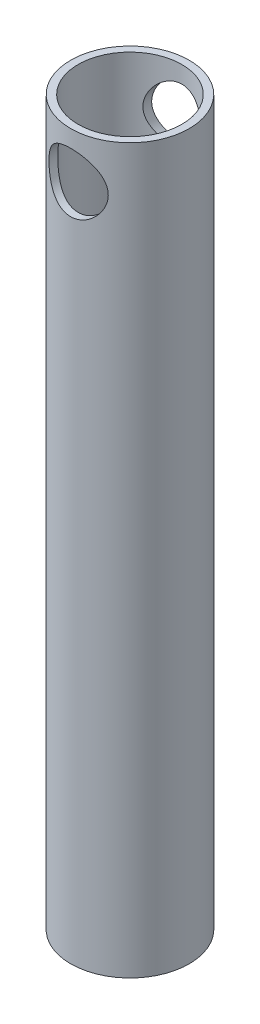
ISO-10303-21;
HEADER;
FILE_DESCRIPTION(('STEP AP214'),'2;1');
FILE_NAME('part.step','',(''),(''),'','','');
FILE_SCHEMA(('AUTOMOTIVE_DESIGN { 1 0 10303 214 1 1 1 1 }'));
ENDSEC;
DATA;
#1=APPLICATION_CONTEXT('core data for automotive mechanical design processes');
#2=APPLICATION_PROTOCOL_DEFINITION('international standard','automotive_design',2000,#1);
#3=PRODUCT_CONTEXT('',#1,'mechanical');
#4=PRODUCT('Part','Part','',(#3));
#5=PRODUCT_RELATED_PRODUCT_CATEGORY('part','',(#4));
#6=PRODUCT_DEFINITION_FORMATION('','',#4);
#7=PRODUCT_DEFINITION_CONTEXT('part definition',#1,'design');
#8=PRODUCT_DEFINITION('design','',#6,#7);
#9=PRODUCT_DEFINITION_SHAPE('','',#8);
#10=(LENGTH_UNIT() NAMED_UNIT(*) SI_UNIT(.MILLI.,.METRE.));
#11=(NAMED_UNIT(*) PLANE_ANGLE_UNIT() SI_UNIT($,.RADIAN.));
#12=(NAMED_UNIT(*) SI_UNIT($,.STERADIAN.) SOLID_ANGLE_UNIT());
#13=UNCERTAINTY_MEASURE_WITH_UNIT(LENGTH_MEASURE(1.E-05),#10,'distance_accuracy_value','');
#14=(GEOMETRIC_REPRESENTATION_CONTEXT(3) GLOBAL_UNCERTAINTY_ASSIGNED_CONTEXT((#13)) GLOBAL_UNIT_ASSIGNED_CONTEXT((#10,
#11,#12)) REPRESENTATION_CONTEXT('',''));
#15=CARTESIAN_POINT('',(0.,0.,0.));
#16=DIRECTION('',(0.,0.,1.));
#17=DIRECTION('',(1.,0.,0.));
#18=AXIS2_PLACEMENT_3D('',#15,#16,#17);
#19=CARTESIAN_POINT('',(0.,155.,0.));
#20=DIRECTION('',(0.,1.,0.));
#21=DIRECTION('',(0.,0.,1.));
#22=AXIS2_PLACEMENT_3D('',#19,#20,#21);
#23=PLANE('',#22);
#24=CARTESIAN_POINT('',(0.,155.,0.));
#25=DIRECTION('',(0.,1.,0.));
#26=DIRECTION('',(0.,0.,1.));
#27=AXIS2_PLACEMENT_3D('',#24,#25,#26);
#28=CIRCLE('',#27,12.7);
#29=CARTESIAN_POINT('',(0.,155.,12.7));
#30=VERTEX_POINT('',#29);
#31=EDGE_CURVE('E11',#30,#30,#28,.T.);
#32=ORIENTED_EDGE('',*,*,#31,.T.);
#33=EDGE_LOOP('',(#32));
#34=FACE_BOUND('',#33,.T.);
#35=CARTESIAN_POINT('',(0.,155.,0.));
#36=DIRECTION('',(0.,1.,0.));
#37=DIRECTION('',(1.,0.,0.));
#38=AXIS2_PLACEMENT_3D('',#35,#36,#37);
#39=CIRCLE('',#38,11.1125);
#40=CARTESIAN_POINT('',(11.1125,155.,0.));
#41=VERTEX_POINT('',#40);
#42=EDGE_CURVE('E55',#41,#41,#39,.T.);
#43=ORIENTED_EDGE('',*,*,#42,.F.);
#44=EDGE_LOOP('',(#43));
#45=FACE_BOUND('',#44,.T.);
#46=ADVANCED_FACE('F37',(#34,#45),#23,.T.);
#47=CARTESIAN_POINT('',(0.,0.,0.));
#48=DIRECTION('',(0.,1.,0.));
#49=DIRECTION('',(0.,0.,1.));
#50=AXIS2_PLACEMENT_3D('',#47,#48,#49);
#51=PLANE('',#50);
#52=CARTESIAN_POINT('',(0.,0.,0.));
#53=DIRECTION('',(0.,1.,0.));
#54=DIRECTION('',(0.,0.,1.));
#55=AXIS2_PLACEMENT_3D('',#52,#53,#54);
#56=CIRCLE('',#55,12.7);
#57=CARTESIAN_POINT('',(0.,0.,12.7));
#58=VERTEX_POINT('',#57);
#59=EDGE_CURVE('E50',#58,#58,#56,.T.);
#60=ORIENTED_EDGE('',*,*,#59,.F.);
#61=EDGE_LOOP('',(#60));
#62=FACE_BOUND('',#61,.T.);
#63=CARTESIAN_POINT('',(0.,0.,0.));
#64=DIRECTION('',(0.,1.,0.));
#65=DIRECTION('',(1.,0.,0.));
#66=AXIS2_PLACEMENT_3D('',#63,#64,#65);
#67=CIRCLE('',#66,11.1125);
#68=CARTESIAN_POINT('',(11.1125,0.,0.));
#69=VERTEX_POINT('',#68);
#70=EDGE_CURVE('E58',#69,#69,#67,.T.);
#71=ORIENTED_EDGE('',*,*,#70,.T.);
#72=EDGE_LOOP('',(#71));
#73=FACE_BOUND('',#72,.T.);
#74=ADVANCED_FACE('F91',(#62,#73),#51,.F.);
#75=CARTESIAN_POINT('',(0.,155.,0.));
#76=DIRECTION('',(0.,-1.,0.));
#77=DIRECTION('',(0.,0.,-1.));
#78=AXIS2_PLACEMENT_3D('',#75,#76,#77);
#79=CYLINDRICAL_SURFACE('',#78,12.7);
#80=CARTESIAN_POINT('',(0.,151.35,-12.7));
#81=CARTESIAN_POINT('',(-0.166990879194914,151.349999442176,-12.6999994891774));
#82=CARTESIAN_POINT('',(-0.333993450198632,151.343405171199,-12.6966986728259));
#83=CARTESIAN_POINT('',(-0.666768526640046,151.317103328668,-12.6835786203218));
#84=CARTESIAN_POINT('',(-0.83254046522313,151.297390052408,-12.6737565484519));
#85=CARTESIAN_POINT('',(-1.16177467728404,151.245046201311,-12.6478292478082));
#86=CARTESIAN_POINT('',(-1.32523331106835,151.21239720482,-12.6317150589571));
#87=CARTESIAN_POINT('',(-1.64849348247789,151.134543670023,-12.5936085062318));
#88=CARTESIAN_POINT('',(-1.80829349634147,151.089333999762,-12.5716137398496));
#89=CARTESIAN_POINT('',(-2.12244180878878,150.987061180329,-12.5223959142721));
#90=CARTESIAN_POINT('',(-2.27681076158407,150.930050337944,-12.4951959650805));
#91=CARTESIAN_POINT('',(-2.57993454237573,150.804600278059,-12.4361502699189));
#92=CARTESIAN_POINT('',(-2.72868724185101,150.736156779923,-12.4043027843762));
#93=CARTESIAN_POINT('',(-3.16512812193646,150.514591673514,-12.302881193969));
#94=CARTESIAN_POINT('',(-3.44334503957524,150.345121641039,-12.2273713354024));
#95=CARTESIAN_POINT('',(-3.98471796121714,149.956057493986,-12.0622186773861));
#96=CARTESIAN_POINT('',(-4.24594454614362,149.734051241793,-11.9719972312188));
#97=CARTESIAN_POINT('',(-4.72936553155196,149.251148191196,-11.7893960148839));
#98=CARTESIAN_POINT('',(-4.95153018780438,148.990222033744,-11.6970146601478));
#99=CARTESIAN_POINT('',(-5.25955398778229,148.562824866709,-11.5603243398217));
#100=CARTESIAN_POINT('',(-5.3610627049131,148.408203893761,-11.5134721485475));
#101=CARTESIAN_POINT('',(-5.55058368760465,148.089947615475,-11.4233099497228));
#102=CARTESIAN_POINT('',(-5.6386015832921,147.92631610947,-11.3799984680683));
#103=CARTESIAN_POINT('',(-5.80035808289102,147.590947864405,-11.2984098057888));
#104=CARTESIAN_POINT('',(-5.87409762464255,147.419211658605,-11.2601322945723));
#105=CARTESIAN_POINT('',(-6.00645788836521,147.0688169432,-11.1900882100936));
#106=CARTESIAN_POINT('',(-6.06508754416239,146.890162596208,-11.1583177917589));
#107=CARTESIAN_POINT('',(-6.16347180761615,146.53802379103,-11.104259497995));
#108=CARTESIAN_POINT('',(-6.20414249112448,146.364864982511,-11.08151961136));
#109=CARTESIAN_POINT('',(-6.27089941680449,146.014910090095,-11.0438804844397));
#110=CARTESIAN_POINT('',(-6.29698628284913,145.838114162125,-11.0289809087597));
#111=CARTESIAN_POINT('',(-6.33415533919377,145.482590705236,-11.0076763086803));
#112=CARTESIAN_POINT('',(-6.34525022098377,145.303864939404,-11.0012640993806));
#113=CARTESIAN_POINT('',(-6.35229110757549,144.946023457694,-10.9972004886715));
#114=CARTESIAN_POINT('',(-6.34823855771195,144.766907780649,-10.9995482514047));
#115=CARTESIAN_POINT('',(-6.32645177136463,144.431417698125,-11.012090292946));
#116=CARTESIAN_POINT('',(-6.31041699475489,144.27489264013,-11.0213095833287));
#117=CARTESIAN_POINT('',(-6.2668713449148,143.963909465342,-11.046128374712));
#118=CARTESIAN_POINT('',(-6.23935668847138,143.809452047278,-11.0617299789813));
#119=CARTESIAN_POINT('',(-6.1731687344852,143.503688703298,-11.0988027904553));
#120=CARTESIAN_POINT('',(-6.13449690187388,143.352382366441,-11.120273227066));
#121=CARTESIAN_POINT('',(-6.04639785576763,143.053761357997,-11.1684190383084));
#122=CARTESIAN_POINT('',(-5.99696641549927,142.906448280758,-11.1950964580098));
#123=CARTESIAN_POINT('',(-5.83067999912413,142.465071273065,-11.2831376118079));
#124=CARTESIAN_POINT('',(-5.69733157989736,142.178449437806,-11.351625656313));
#125=CARTESIAN_POINT('',(-5.39139880582654,141.630423149883,-11.500071400071));
#126=CARTESIAN_POINT('',(-5.21879682720649,141.36903009957,-11.5800342452273));
#127=CARTESIAN_POINT('',(-4.81373716307424,140.843812569041,-11.7546812882033));
#128=CARTESIAN_POINT('',(-4.57646495884524,140.583882329649,-11.8499465086129));
#129=CARTESIAN_POINT('',(-4.06112275052912,140.105796599138,-12.0362854764244));
#130=CARTESIAN_POINT('',(-3.78303336001457,139.887661072859,-12.1273572049435));
#131=CARTESIAN_POINT('',(-3.33286643739699,139.591778625483,-12.255938857257));
#132=CARTESIAN_POINT('',(-3.17335722609794,139.496640153278,-12.2983050254296));
#133=CARTESIAN_POINT('',(-2.8456977162644,139.320293288756,-12.3782218301755));
#134=CARTESIAN_POINT('',(-2.67755134695864,139.239078633871,-12.4157746297482));
#135=CARTESIAN_POINT('',(-2.33378760343932,139.091453428893,-12.4849579292559));
#136=CARTESIAN_POINT('',(-2.1581731635514,139.025037127134,-12.5165907293456));
#137=CARTESIAN_POINT('',(-1.80074808519268,138.907778340018,-12.5729876360055));
#138=CARTESIAN_POINT('',(-1.61893816219403,138.856934063085,-12.5977525327026));
#139=CARTESIAN_POINT('',(-1.26593635485429,138.775053040255,-12.6378915597613));
#140=CARTESIAN_POINT('',(-1.09511243698786,138.742724413691,-12.6538736459652));
#141=CARTESIAN_POINT('',(-0.750891318848441,138.692154411637,-12.6789562420375));
#142=CARTESIAN_POINT('',(-0.577494259066553,138.6739122699,-12.6880571262137));
#143=CARTESIAN_POINT('',(-0.229629611373421,138.651761276101,-12.6991158370576));
#144=CARTESIAN_POINT('',(-0.0551624794535654,138.647846693207,-12.7010765197081));
#145=CARTESIAN_POINT('',(0.29343050741757,138.654388607949,-12.6978059034872));
#146=CARTESIAN_POINT('',(0.467556377130837,138.66484446958,-12.6925749229034));
#147=CARTESIAN_POINT('',(0.800509536744072,138.698613631521,-12.6757555094506));
#148=CARTESIAN_POINT('',(0.959472887164146,138.720863074002,-12.6646934781011));
#149=CARTESIAN_POINT('',(1.2748284005213,138.777221162482,-12.6368459564446));
#150=CARTESIAN_POINT('',(1.43121967165999,138.811333834582,-12.6200585231077));
#151=CARTESIAN_POINT('',(1.74030776864039,138.891047952959,-12.581159973299));
#152=CARTESIAN_POINT('',(1.89300576133385,138.936645717272,-12.5590505630802));
#153=CARTESIAN_POINT('',(2.19390570072534,139.038914391058,-12.5099971792976));
#154=CARTESIAN_POINT('',(2.34210587161403,139.095589610032,-12.4830513245292));
#155=CARTESIAN_POINT('',(2.6372585623889,139.221262293972,-12.4240951779885));
#156=CARTESIAN_POINT('',(2.78405822350622,139.290562005097,-12.3919635638501));
#157=CARTESIAN_POINT('',(3.07126756713195,139.439781394078,-12.32392525103));
#158=CARTESIAN_POINT('',(3.21167506178121,139.519704671936,-12.2880172735192));
#159=CARTESIAN_POINT('',(3.62227376445687,139.774549113681,-12.1757741292216));
#160=CARTESIAN_POINT('',(3.88199540128409,139.964611078788,-12.0948877082824));
#161=CARTESIAN_POINT('',(4.39279994151145,140.401139844167,-11.9194499483036));
#162=CARTESIAN_POINT('',(4.640529903727,140.651312805133,-11.8243367236915));
#163=CARTESIAN_POINT('',(4.9789239543965,141.054910089851,-11.6839772811164));
#164=CARTESIAN_POINT('',(5.08625380253177,141.19427610514,-11.6375432562751));
#165=CARTESIAN_POINT('',(5.2892990887901,141.481933742679,-11.5466734049483));
#166=CARTESIAN_POINT('',(5.38501278922795,141.630226695378,-11.5022378780468));
#167=CARTESIAN_POINT('',(5.56849389071524,141.942428100611,-11.4145838039713));
#168=CARTESIAN_POINT('',(5.65564549590476,142.106745444051,-11.3715304916549));
#169=CARTESIAN_POINT('',(5.8155690937668,142.4433705339,-11.290579644901));
#170=CARTESIAN_POINT('',(5.88834801781483,142.615674378989,-11.2526796279935));
#171=CARTESIAN_POINT('',(6.01870593214494,142.967079164159,-11.1834979926119));
#172=CARTESIAN_POINT('',(6.07629712370973,143.146174515059,-11.1522110654535));
#173=CARTESIAN_POINT('',(6.17556605056228,143.50989833802,-11.0975495796607));
#174=CARTESIAN_POINT('',(6.21724624980145,143.694525948584,-11.0741737959829));
#175=CARTESIAN_POINT('',(6.28083303239844,144.049738258525,-11.038221566145));
#176=CARTESIAN_POINT('',(6.30425367574492,144.219969699185,-11.0248238589961));
#177=CARTESIAN_POINT('',(6.33722186745437,144.562205973691,-11.0059068618669));
#178=CARTESIAN_POINT('',(6.34677035930014,144.734210686132,-11.0003870360907));
#179=CARTESIAN_POINT('',(6.35184755649859,145.078431283434,-10.9974561088362));
#180=CARTESIAN_POINT('',(6.34738144738997,145.250647066626,-11.0000420081603));
#181=CARTESIAN_POINT('',(6.32451076696087,145.593833666046,-11.0132073594892));
#182=CARTESIAN_POINT('',(6.3061067662514,145.764804532951,-11.023786484255));
#183=CARTESIAN_POINT('',(6.25804920718462,146.087829689896,-11.0511312712702));
#184=CARTESIAN_POINT('',(6.22963986719981,146.240129318021,-11.0672085028909));
#185=CARTESIAN_POINT('',(6.16196939123336,146.541600360668,-11.1050268373618));
#186=CARTESIAN_POINT('',(6.12270465222517,146.690770718833,-11.1267698205995));
#187=CARTESIAN_POINT('',(5.98919755549726,147.132224331588,-11.1995485940621));
#188=CARTESIAN_POINT('',(5.87921095671372,147.418657019092,-11.2581531108883));
#189=CARTESIAN_POINT('',(5.61221709335547,147.988516005532,-11.3937155944897));
#190=CARTESIAN_POINT('',(5.45254719309571,148.270447397452,-11.4716421113511));
#191=CARTESIAN_POINT('',(5.09367320950779,148.805373073371,-11.635439817654));
#192=CARTESIAN_POINT('',(4.89444855823948,149.058352194233,-11.7213151279082));
#193=CARTESIAN_POINT('',(4.43354035272871,149.560238255138,-11.9038699110716));
#194=CARTESIAN_POINT('',(4.1672089491442,149.804915432735,-12.0005943076297));
#195=CARTESIAN_POINT('',(3.73813634318357,150.136306049974,-12.1383310810892));
#196=CARTESIAN_POINT('',(3.59004569732538,150.240905091954,-12.1830529217554));
#197=CARTESIAN_POINT('',(3.28473589884857,150.4374551776,-12.2688872478125));
#198=CARTESIAN_POINT('',(3.12752095014405,150.52941198126,-12.3100013738234));
#199=CARTESIAN_POINT('',(2.80361177397835,150.700533108515,-12.3878055405892));
#200=CARTESIAN_POINT('',(2.63685404738454,150.77959381996,-12.4244591999769));
#201=CARTESIAN_POINT('',(2.2961439976254,150.923206285418,-12.4919115290982));
#202=CARTESIAN_POINT('',(2.12219525894011,150.987765167276,-12.5227130740716));
#203=CARTESIAN_POINT('',(1.76872534139741,151.10151674034,-12.5775008101552));
#204=CARTESIAN_POINT('',(1.58921727277205,151.150742946002,-12.6015018553988));
#205=CARTESIAN_POINT('',(1.22585054083135,151.233335269034,-12.642019952057));
#206=CARTESIAN_POINT('',(1.04199460738348,151.266711074581,-12.6585415748002));
#207=CARTESIAN_POINT('',(0.715063028653905,151.311232561924,-12.6806500718221));
#208=CARTESIAN_POINT('',(0.572548812651063,151.325757901848,-12.6878936037074));
#209=CARTESIAN_POINT('',(0.286692618188964,151.345141993719,-12.6975688534566));
#210=CARTESIAN_POINT('',(0.143350616991767,151.350000478855,-12.7000004385074));
#211=CARTESIAN_POINT('',(0.,151.35,-12.7));
#212=B_SPLINE_CURVE_WITH_KNOTS('',3,(#80,#81,#82,#83,#84,#85,#86,#87,#88,#89,#90,#91,#92,#93,
#94,#95,#96,#97,#98,#99,#100,#101,#102,#103,#104,#105,#106,#107,#108,#109,#110,#111,#112,#113,
#114,#115,#116,#117,#118,#119,#120,#121,#122,#123,#124,#125,#126,#127,#128,#129,#130,#131,#132,
#133,#134,#135,#136,#137,#138,#139,#140,#141,#142,#143,#144,#145,#146,#147,#148,#149,#150,#151,
#152,#153,#154,#155,#156,#157,#158,#159,#160,#161,#162,#163,#164,#165,#166,#167,#168,#169,#170,
#171,#172,#173,#174,#175,#176,#177,#178,#179,#180,#181,#182,#183,#184,#185,#186,#187,#188,#189,
#190,#191,#192,#193,#194,#195,#196,#197,#198,#199,#200,#201,#202,#203,#204,#205,#206,#207,#208,
#209,#210,#211),.UNSPECIFIED.,.T.,.F.,(4,2,2,2,2,2,2,2,2,2,2,2,2,2,2,2,2,2,2,2,2,2,2,2,2,2,2,2,
2,2,2,2,2,2,2,2,2,2,2,2,2,2,2,2,2,2,2,2,2,2,2,2,2,2,2,2,2,2,2,2,2,2,2,2,2,4),(0.,
0.500831224205362,1.00188037372803,1.5036456429069,2.00561622220709,2.50540779268628,
3.0053869172507,4.00425210956756,5.06354639773447,6.12364383897772,6.69546056113472,
7.26703799333408,7.8385778700712,8.40977904053164,8.94696617231637,9.48413032231426,
10.020839449589,10.5574973665628,11.0297819407841,11.5022222802448,11.9746006167424,
12.447164856978,13.4133450583963,14.3799599077215,15.4691385823987,16.5588362547139,
17.1296896955319,17.7002857039293,18.2706595507726,18.8409677509571,19.3640345307036,
19.8870728558157,20.4099019497636,20.9327079051584,21.4148301207384,21.8971161172382,
22.3792476958438,22.8615672144633,23.3574791185916,23.8535595025871,24.845213267335,
25.9342484207189,26.4795520760265,27.0249372042286,27.5969396508644,28.1686655660688,
28.7399307681393,29.3111074690516,29.8274552059118,30.3437678229116,30.8598894217494,
31.3759898919437,31.8427315926275,32.3096283963947,33.2427989036526,34.2386648311406,
35.2350499582129,36.3525027406484,36.9121724680045,37.4715863502977,38.0352942497766,
38.5987244700203,39.1609143479984,39.7227601571806,40.1526787482413,40.5826092051903),.UNSPECIFIED.);
#213=CARTESIAN_POINT('',(0.,151.35,-12.7));
#214=VERTEX_POINT('',#213);
#215=EDGE_CURVE('E81',#214,#214,#212,.T.);
#216=ORIENTED_EDGE('',*,*,#215,.T.);
#217=EDGE_LOOP('',(#216));
#218=FACE_BOUND('',#217,.T.);
#219=CARTESIAN_POINT('',(6.35,145.,10.9985226280624));
#220=CARTESIAN_POINT('',(6.34999928218839,144.834478959025,10.998523579943));
#221=CARTESIAN_POINT('',(6.34351956503949,144.668943488373,11.0022718933855));
#222=CARTESIAN_POINT('',(6.31768567038666,144.339148250555,11.0171259639553));
#223=CARTESIAN_POINT('',(6.29832549915769,144.174889113329,11.028235146342));
#224=CARTESIAN_POINT('',(6.24694927679313,143.848730138198,11.0574181332929));
#225=CARTESIAN_POINT('',(6.21491337833216,143.686834415054,11.0755028588591));
#226=CARTESIAN_POINT('',(6.13857317393676,143.366749115066,11.1179955136528));
#227=CARTESIAN_POINT('',(6.09426353293934,143.208561182403,11.1424061923026));
#228=CARTESIAN_POINT('',(5.99415903275058,142.897849107027,11.1965740900206));
#229=CARTESIAN_POINT('',(5.93843230829519,142.745297426238,11.2262994639536));
#230=CARTESIAN_POINT('',(5.81586008035333,142.445689113014,11.2902857666197));
#231=CARTESIAN_POINT('',(5.74901027400277,142.298634634189,11.324548449519));
#232=CARTESIAN_POINT('',(5.53261246616049,141.8669214841,11.4326803315475));
#233=CARTESIAN_POINT('',(5.36712033451896,141.591419098183,11.5119476642213));
#234=CARTESIAN_POINT('',(4.98262520033463,141.048316307068,11.6838071707141));
#235=CARTESIAN_POINT('',(4.76033450949029,140.78324177728,11.7769591251894));
#236=CARTESIAN_POINT('',(4.27511757646096,140.292039436216,11.9616298271453));
#237=CARTESIAN_POINT('',(4.01217118797673,140.065931052113,12.0531477396846));
#238=CARTESIAN_POINT('',(3.58181894118664,139.753339129179,12.1854533541462));
#239=CARTESIAN_POINT('',(3.42694042984284,139.650866890808,12.2300194911332));
#240=CARTESIAN_POINT('',(3.10796653038441,139.45945951178,12.3149390761008));
#241=CARTESIAN_POINT('',(2.94387511411646,139.370518597955,12.3552943183467));
#242=CARTESIAN_POINT('',(2.6075308316917,139.207052061708,12.4306269282563));
#243=CARTESIAN_POINT('',(2.43527996416924,139.13252293166,12.4656056040746));
#244=CARTESIAN_POINT('',(2.0838121624779,138.998702643235,12.5291499729456));
#245=CARTESIAN_POINT('',(1.90459597055365,138.939409866327,12.557716347125));
#246=CARTESIAN_POINT('',(1.55360110174849,138.840481575007,12.6057699490627));
#247=CARTESIAN_POINT('',(1.38220025705053,138.799747753862,12.6257584795993));
#248=CARTESIAN_POINT('',(1.03596010191726,138.732594066716,12.6588712483437));
#249=CARTESIAN_POINT('',(0.861120941321367,138.706173578377,12.6719957849948));
#250=CARTESIAN_POINT('',(0.509545670906198,138.668008703585,12.6909944382569));
#251=CARTESIAN_POINT('',(0.332810574148244,138.656256838193,12.696872249662));
#252=CARTESIAN_POINT('',(-0.0211100399708893,138.64756882551,12.7012151345855));
#253=CARTESIAN_POINT('',(-0.198295529111752,138.650631771773,12.6996806616256));
#254=CARTESIAN_POINT('',(-0.536139024534008,138.670612659613,12.6897037555826));
#255=CARTESIAN_POINT('',(-0.696889924585389,138.686298142591,12.6818758695979));
#256=CARTESIAN_POINT('',(-1.01639364208415,138.729797080991,12.6602759613241));
#257=CARTESIAN_POINT('',(-1.17514576438736,138.757614642086,12.6465019267876));
#258=CARTESIAN_POINT('',(-1.4894584532589,138.825063409619,12.6133453485308));
#259=CARTESIAN_POINT('',(-1.64502010399353,138.864690529455,12.593964744986));
#260=CARTESIAN_POINT('',(-1.95208375259316,138.955373351982,12.5500373997279));
#261=CARTESIAN_POINT('',(-2.10358417059946,139.006433431989,12.5254886795239));
#262=CARTESIAN_POINT('',(-2.40359618388373,139.120263336531,12.4714177118698));
#263=CARTESIAN_POINT('',(-2.55204052401201,139.183180905512,12.4418332261982));
#264=CARTESIAN_POINT('',(-2.84303753803177,139.319726734807,12.378584432143));
#265=CARTESIAN_POINT('',(-2.98558805909761,139.393358865195,12.3449186503414));
#266=CARTESIAN_POINT('',(-3.40330077674667,139.629504557902,12.2388667565259));
#267=CARTESIAN_POINT('',(-3.66870594884561,139.807337007521,12.1613919912876));
#268=CARTESIAN_POINT('',(-4.19214222770384,140.217794287102,11.9916143211519));
#269=CARTESIAN_POINT('',(-4.44710477439445,140.454009488911,11.898602021058));
#270=CARTESIAN_POINT('',(-4.91557936546448,140.965189528168,11.7128389704504));
#271=CARTESIAN_POINT('',(-5.12905951809202,141.24018390104,11.6200884747731));
#272=CARTESIAN_POINT('',(-5.42030469839432,141.686818815703,11.485763619987));
#273=CARTESIAN_POINT('',(-5.51485253989249,141.846659687386,11.4405392812176));
#274=CARTESIAN_POINT('',(-5.68998308667919,142.174907523068,11.3544526819022));
#275=CARTESIAN_POINT('',(-5.77057209166415,142.343310578288,11.3135884568282));
#276=CARTESIAN_POINT('',(-5.91694414691516,142.687588479242,11.2377300009331));
#277=CARTESIAN_POINT('',(-5.98273594112008,142.863458838977,11.2027323066041));
#278=CARTESIAN_POINT('',(-6.09876240466926,143.221519101615,11.1399935280696));
#279=CARTESIAN_POINT('',(-6.14899919531465,143.403708139041,11.1122514544649));
#280=CARTESIAN_POINT('',(-6.22984578561014,143.758260672572,11.0671130870127));
#281=CARTESIAN_POINT('',(-6.26169488894776,143.930259605157,11.0490714421643));
#282=CARTESIAN_POINT('',(-6.31112791295724,144.276941802449,11.0209110407547));
#283=CARTESIAN_POINT('',(-6.32871263976523,144.451624914893,11.0107918364662));
#284=CARTESIAN_POINT('',(-6.34933783360541,144.802026504179,10.9989113917305));
#285=CARTESIAN_POINT('',(-6.35238708733638,144.977744291214,10.9971451019486));
#286=CARTESIAN_POINT('',(-6.34391512771207,145.328703199938,11.0020346573697));
#287=CARTESIAN_POINT('',(-6.33239489785529,145.503944353002,11.0086899340833));
#288=CARTESIAN_POINT('',(-6.29702858834734,145.833227933237,11.0289522068901));
#289=CARTESIAN_POINT('',(-6.27467427125266,145.987485852486,11.0417159534014));
#290=CARTESIAN_POINT('',(-6.21882742556196,146.293394537893,11.0732657413811));
#291=CARTESIAN_POINT('',(-6.18533121331014,146.445044424341,11.092053774483));
#292=CARTESIAN_POINT('',(-6.10756307635574,146.74474396776,11.1350636737862));
#293=CARTESIAN_POINT('',(-6.06329255357283,146.892794090366,11.1592848330139));
#294=CARTESIAN_POINT('',(-5.96439741652118,147.184542541514,11.2124534540252));
#295=CARTESIAN_POINT('',(-5.90976876141912,147.328239146238,11.2414027597031));
#296=CARTESIAN_POINT('',(-5.72551537265919,147.76469368686,11.3370282812367));
#297=CARTESIAN_POINT('',(-5.57907708861787,148.049098779655,11.4104161169009));
#298=CARTESIAN_POINT('',(-5.24691806986894,148.590767871184,11.5669168187709));
#299=CARTESIAN_POINT('',(-5.06117715583607,148.848017825444,11.6500346708705));
#300=CARTESIAN_POINT('',(-4.62807762638645,149.362333653309,11.8292979432129));
#301=CARTESIAN_POINT('',(-4.37590319113318,149.615288664133,11.9257648232535));
#302=CARTESIAN_POINT('',(-3.96769139976498,149.961033989359,12.065166834861));
#303=CARTESIAN_POINT('',(-3.82651789934348,150.070733981887,12.1107817083111));
#304=CARTESIAN_POINT('',(-3.53483089216951,150.278205287783,12.1991040176717));
#305=CARTESIAN_POINT('',(-3.38432138656765,150.375981658719,12.2418126828684));
#306=CARTESIAN_POINT('',(-3.07056676226709,150.561314306559,12.324311106221));
#307=CARTESIAN_POINT('',(-2.90708752656755,150.648523439714,12.363990945484));
#308=CARTESIAN_POINT('',(-2.5721944107138,150.808678202338,12.4379740868991));
#309=CARTESIAN_POINT('',(-2.40078408675028,150.881630149332,12.4722797690599));
#310=CARTESIAN_POINT('',(-2.0512653593288,151.012454756968,12.5345044268709));
#311=CARTESIAN_POINT('',(-1.87316019735423,151.070334610233,12.5624264481184));
#312=CARTESIAN_POINT('',(-1.51161329943788,151.170307055066,12.6110379217182));
#313=CARTESIAN_POINT('',(-1.32817219909653,151.212401518709,12.631728231699));
#314=CARTESIAN_POINT('',(-0.974600005100294,151.277095576751,12.6636770700622));
#315=CARTESIAN_POINT('',(-0.804792658673197,151.301129888792,12.6756269918235));
#316=CARTESIAN_POINT('',(-0.46345365091476,151.335386692103,12.6926908731773));
#317=CARTESIAN_POINT('',(-0.291922123840614,151.345610250512,12.6978053609347));
#318=CARTESIAN_POINT('',(0.0514197228064791,151.352112324678,12.7010560032391));
#319=CARTESIAN_POINT('',(0.223229946689187,151.348394898908,12.6991941887141));
#320=CARTESIAN_POINT('',(0.565766947207412,151.327072899227,12.6885485999153));
#321=CARTESIAN_POINT('',(0.736493753538921,151.309468707619,12.6797650161974));
#322=CARTESIAN_POINT('',(1.06426294389699,151.262221827235,12.656323875626));
#323=CARTESIAN_POINT('',(1.22146310076638,151.233453133058,12.6420936187697));
#324=CARTESIAN_POINT('',(1.53273401365724,151.164304658465,12.6081419891862));
#325=CARTESIAN_POINT('',(1.68680375641299,151.123921180666,12.5884188679554));
#326=CARTESIAN_POINT('',(1.99076490548927,151.031961705446,12.5439405267035));
#327=CARTESIAN_POINT('',(2.14065747495022,150.980388859582,12.5191867237303));
#328=CARTESIAN_POINT('',(2.43552149277719,150.866491998369,12.4651801096243));
#329=CARTESIAN_POINT('',(2.58049099991492,150.804163799623,12.4359255483614));
#330=CARTESIAN_POINT('',(2.87074641869221,150.666409622443,12.3722192421227));
#331=CARTESIAN_POINT('',(3.01578543185329,150.59054054922,12.3375997987591));
#332=CARTESIAN_POINT('',(3.29896153439148,150.428260237012,12.2649198034212));
#333=CARTESIAN_POINT('',(3.43709624818683,150.341845404238,12.2268580795355));
#334=CARTESIAN_POINT('',(3.84016496827813,150.067659743303,12.1087310292377));
#335=CARTESIAN_POINT('',(4.09390524315912,149.864880017551,12.0246914862318));
#336=CARTESIAN_POINT('',(4.5905787750526,149.401768441753,11.8445434508042));
#337=CARTESIAN_POINT('',(4.82992340312281,149.137717377949,11.7480662044738));
#338=CARTESIAN_POINT('',(5.15393253428056,148.713655057777,11.6077957563044));
#339=CARTESIAN_POINT('',(5.2561719682572,148.567502296364,11.561743086175));
#340=CARTESIAN_POINT('',(5.44837322320644,148.266435970663,11.472420936867));
#341=CARTESIAN_POINT('',(5.53833333567739,148.111521191493,11.4291518454276));
#342=CARTESIAN_POINT('',(5.70789559273796,147.788679501392,11.3454468235068));
#343=CARTESIAN_POINT('',(5.7870743435929,147.620494869675,11.3051457990152));
#344=CARTESIAN_POINT('',(5.93072175033349,147.276775259839,11.2304539202442));
#345=CARTESIAN_POINT('',(5.99519798249186,147.101244122851,11.1960600242609));
#346=CARTESIAN_POINT('',(6.10854208064732,146.744464748163,11.1346246153698));
#347=CARTESIAN_POINT('',(6.15745010027587,146.563232564874,11.1075642151338));
#348=CARTESIAN_POINT('',(6.23913851107982,146.196222244943,11.0618875330189));
#349=CARTESIAN_POINT('',(6.27193017812066,146.010447382406,11.0432653480253));
#350=CARTESIAN_POINT('',(6.31421523734848,145.687072815032,11.0191238073291));
#351=CARTESIAN_POINT('',(6.32762170528343,145.55013331219,11.0114171350384));
#352=CARTESIAN_POINT('',(6.34551468363466,145.27546590502,11.0011159783553));
#353=CARTESIAN_POINT('',(6.35000059732526,145.137737948567,10.9985218359571));
#354=CARTESIAN_POINT('',(6.35,145.,10.9985226280624));
#355=B_SPLINE_CURVE_WITH_KNOTS('',3,(#219,#220,#221,#222,#223,#224,#225,#226,#227,#228,#229,
#230,#231,#232,#233,#234,#235,#236,#237,#238,#239,#240,#241,#242,#243,#244,#245,#246,#247,#248,
#249,#250,#251,#252,#253,#254,#255,#256,#257,#258,#259,#260,#261,#262,#263,#264,#265,#266,#267,
#268,#269,#270,#271,#272,#273,#274,#275,#276,#277,#278,#279,#280,#281,#282,#283,#284,#285,#286,
#287,#288,#289,#290,#291,#292,#293,#294,#295,#296,#297,#298,#299,#300,#301,#302,#303,#304,#305,
#306,#307,#308,#309,#310,#311,#312,#313,#314,#315,#316,#317,#318,#319,#320,#321,#322,#323,#324,
#325,#326,#327,#328,#329,#330,#331,#332,#333,#334,#335,#336,#337,#338,#339,#340,#341,#342,#343,
#344,#345,#346,#347,#348,#349,#350,#351,#352,#353,#354),.UNSPECIFIED.,.T.,.F.,(4,2,2,2,2,2,2,2,
2,2,2,2,2,2,2,2,2,2,2,2,2,2,2,2,2,2,2,2,2,2,2,2,2,2,2,2,2,2,2,2,2,2,2,2,2,2,2,2,2,2,2,2,2,2,2,2,
2,2,2,2,2,2,2,2,2,2,2,4),(0.,0.496420628386746,0.993072420345703,1.49050495383882,
1.98815404798092,2.48291553757601,2.9778688680815,3.96684409062693,5.03738796841401,
6.10846404790778,6.68078530471611,7.25286169053385,7.82479866524645,8.3966748589543,
8.92786962152971,9.45904128608265,9.98994201685748,10.5208102648013,11.0053494342498,
11.4900527062196,11.9745884449401,12.4593100150646,12.950526958068,13.4419217698919,
14.4241248232063,15.4991729719626,16.5750443780613,17.1478350421015,17.720366525317,
18.2925587952272,18.8646729984724,19.3914775559145,19.9182523394805,20.4447086470812,
20.9711294186693,21.4397670532095,21.908559779714,22.3772915409524,22.8462065377767,
23.8265350298733,24.8073680830597,25.9118399254557,26.4648639531134,27.017652586129,
27.5853637388286,28.1528227588559,28.7200104808045,29.2871309155675,29.802197945893,
30.3172251753647,30.8321024827271,31.3469656160427,31.827748508727,32.3086846208015,
32.7894854495582,33.270473713564,33.7718435732796,34.273384769681,35.2759913103902,
36.3783774564738,36.9304975296671,37.4826943447722,38.0525552763948,38.6221218892067,
39.1902073402293,39.7578947603406,40.1709623989989,40.5840576682025),.UNSPECIFIED.);
#356=CARTESIAN_POINT('',(6.35,145.,10.9985226280624));
#357=VERTEX_POINT('',#356);
#358=EDGE_CURVE('E77',#357,#357,#355,.T.);
#359=ORIENTED_EDGE('',*,*,#358,.T.);
#360=EDGE_LOOP('',(#359));
#361=FACE_BOUND('',#360,.T.);
#362=ORIENTED_EDGE('',*,*,#31,.F.);
#363=EDGE_LOOP('',(#362));
#364=FACE_BOUND('',#363,.T.);
#365=ORIENTED_EDGE('',*,*,#59,.T.);
#366=EDGE_LOOP('',(#365));
#367=FACE_BOUND('',#366,.T.);
#368=ADVANCED_FACE('F39',(#218,#361,#364,#367),#79,.T.);
#369=CARTESIAN_POINT('',(0.,155.,0.));
#370=DIRECTION('',(0.,-1.,0.));
#371=DIRECTION('',(0.,0.,-1.));
#372=AXIS2_PLACEMENT_3D('',#369,#370,#371);
#373=CYLINDRICAL_SURFACE('',#372,11.1125);
#374=CARTESIAN_POINT('',(0.,151.35,-11.1125));
#375=CARTESIAN_POINT('',(-0.163789182274865,151.349998587391,-11.1124987193567));
#376=CARTESIAN_POINT('',(-0.327629128578457,151.343652913242,-11.1088693064788));
#377=CARTESIAN_POINT('',(-0.654085912433475,151.31834675529,-11.0944381185428));
#378=CARTESIAN_POINT('',(-0.816701920974139,151.299378384698,-11.0836318593259));
#379=CARTESIAN_POINT('',(-1.13971905284884,151.249024584509,-11.0550908256635));
#380=CARTESIAN_POINT('',(-1.30011511022562,151.217614458177,-11.03734227173));
#381=CARTESIAN_POINT('',(-1.61726609325167,151.142761220753,-10.9953496184125));
#382=CARTESIAN_POINT('',(-1.77401943318414,151.099312971873,-10.9711027457359));
#383=CARTESIAN_POINT('',(-2.08199776129995,151.001147026139,-10.9168335923382));
#384=CARTESIAN_POINT('',(-2.23324736337085,150.946489421563,-10.8868421620341));
#385=CARTESIAN_POINT('',(-2.53024463011943,150.826324347807,-10.8216761904037));
#386=CARTESIAN_POINT('',(-2.67599018834381,150.760812775354,-10.7864996894518));
#387=CARTESIAN_POINT('',(-3.10359647441188,150.548984297966,-10.674359074649));
#388=CARTESIAN_POINT('',(-3.37622520059919,150.387244995147,-10.5907106620075));
#389=CARTESIAN_POINT('',(-3.9106715073846,150.014277378694,-10.4057691112419));
#390=CARTESIAN_POINT('',(-4.17028523550964,149.800317977128,-10.3036378350192));
#391=CARTESIAN_POINT('',(-4.53141063695516,149.451618019353,-10.1474768125783));
#392=CARTESIAN_POINT('',(-4.64716119796353,149.330636608721,-10.0948805006451));
#393=CARTESIAN_POINT('',(-4.86883414237915,149.079823109888,-9.98985145364251));
#394=CARTESIAN_POINT('',(-4.97475472030148,148.949989403342,-9.93741875032558));
#395=CARTESIAN_POINT('',(-5.18722276491485,148.667395195762,-9.82833425876501));
#396=CARTESIAN_POINT('',(-5.29258286171642,148.513677573716,-9.77184466338238));
#397=CARTESIAN_POINT('',(-5.48986923610041,148.19666718342,-9.66238677907194));
#398=CARTESIAN_POINT('',(-5.58179671018849,148.033375269815,-9.60941817674244));
#399=CARTESIAN_POINT('',(-5.75132663963913,147.698144178537,-9.50892223651364));
#400=CARTESIAN_POINT('',(-5.82894503852306,147.52621490009,-9.46138886525736));
#401=CARTESIAN_POINT('',(-5.96906489099455,147.174525650131,-9.37362073652479));
#402=CARTESIAN_POINT('',(-6.03157130399761,146.994768270542,-9.33338358567887));
#403=CARTESIAN_POINT('',(-6.12848290731384,146.669227060463,-9.2699472013044));
#404=CARTESIAN_POINT('',(-6.16604571819255,146.524727189919,-9.24494802025014));
#405=CARTESIAN_POINT('',(-6.23103019113534,146.232537560372,-9.20127473419396));
#406=CARTESIAN_POINT('',(-6.2584540118862,146.084848487475,-9.18259928288155));
#407=CARTESIAN_POINT('',(-6.30279529830521,145.787320251148,-9.15222116245191));
#408=CARTESIAN_POINT('',(-6.31972201465444,145.637483100235,-9.14051235427911));
#409=CARTESIAN_POINT('',(-6.34286840650351,145.336582516618,-9.12446585084189));
#410=CARTESIAN_POINT('',(-6.34908786840743,145.185519059512,-9.12012830262463));
#411=CARTESIAN_POINT('',(-6.35072675890009,144.883099262711,-9.11898717572708));
#412=CARTESIAN_POINT('',(-6.34613149556416,144.73174280402,-9.12219384594958));
#413=CARTESIAN_POINT('',(-6.32617972925881,144.430087630051,-9.13604137072775));
#414=CARTESIAN_POINT('',(-6.31082318374092,144.279788918958,-9.14668225467717));
#415=CARTESIAN_POINT('',(-6.26956140717988,143.98126785318,-9.17501386064166));
#416=CARTESIAN_POINT('',(-6.24365203082822,143.833046338142,-9.19270735296752));
#417=CARTESIAN_POINT('',(-6.181612291515,143.539634395541,-9.23453963420613));
#418=CARTESIAN_POINT('',(-6.14547779716498,143.394445218686,-9.25868102812731));
#419=CARTESIAN_POINT('',(-6.06358276516131,143.108578857831,-9.31251885941886));
#420=CARTESIAN_POINT('',(-6.01786492154381,142.967884749259,-9.3421905960833));
#421=CARTESIAN_POINT('',(-5.91714143068885,142.690960636889,-9.4063093005039));
#422=CARTESIAN_POINT('',(-5.86213273213707,142.554732117293,-9.44075783639501));
#423=CARTESIAN_POINT('',(-5.68384138406894,142.153590889338,-9.54992330536148));
#424=CARTESIAN_POINT('',(-5.54725255369823,141.896081494694,-9.63048817261377));
#425=CARTESIAN_POINT('',(-5.21723930061993,141.364639573466,-9.8137162070062));
#426=CARTESIAN_POINT('',(-5.01821456576571,141.094688189351,-9.91785171069548));
#427=CARTESIAN_POINT('',(-4.69016607811462,140.715983061579,-10.0749588662349));
#428=CARTESIAN_POINT('',(-4.57580215836227,140.594037600451,-10.127517911557));
#429=CARTESIAN_POINT('',(-4.33757365051822,140.359320387957,-10.2318130372492));
#430=CARTESIAN_POINT('',(-4.21370745945026,140.246550191044,-10.2835489769812));
#431=CARTESIAN_POINT('',(-3.94228596672723,140.018454212943,-10.3908469155461));
#432=CARTESIAN_POINT('',(-3.79364125948813,139.904309669506,-10.4461703100015));
#433=CARTESIAN_POINT('',(-3.4859305021919,139.689065758752,-10.5528406185058));
#434=CARTESIAN_POINT('',(-3.32686871710472,139.587961102357,-10.6041891413932));
#435=CARTESIAN_POINT('',(-2.99915328751337,139.399707373035,-10.7014925093249));
#436=CARTESIAN_POINT('',(-2.83050170205786,139.312555319531,-10.7474485057677));
#437=CARTESIAN_POINT('',(-2.48465393547031,139.153186119468,-10.8326290092149));
#438=CARTESIAN_POINT('',(-2.30745881728339,139.080967120893,-10.8718543508605));
#439=CARTESIAN_POINT('',(-1.95834408609262,138.95688002499,-10.9399248473026));
#440=CARTESIAN_POINT('',(-1.78690503110863,138.903951040479,-10.9692997268987));
#441=CARTESIAN_POINT('',(-1.43906988764793,138.812601323608,-11.0203276192939));
#442=CARTESIAN_POINT('',(-1.26267397979208,138.774180063342,-11.0419809130641));
#443=CARTESIAN_POINT('',(-0.906583181388617,138.712454145979,-11.0769012573418));
#444=CARTESIAN_POINT('',(-0.726891124901351,138.689137075958,-11.0901751939431));
#445=CARTESIAN_POINT('',(-0.365746762294528,138.657952490083,-11.1079501199315));
#446=CARTESIAN_POINT('',(-0.184294655501171,138.650083244823,-11.1124520913529));
#447=CARTESIAN_POINT('',(0.156551233178865,138.649928069854,-11.1125414018011));
#448=CARTESIAN_POINT('',(0.315947453758273,138.655865551773,-11.1091450566475));
#449=CARTESIAN_POINT('',(0.633554741466065,138.679678455907,-11.0955632409524));
#450=CARTESIAN_POINT('',(0.791765828213269,138.697553680059,-11.0853778830491));
#451=CARTESIAN_POINT('',(1.10584248293701,138.745014946456,-11.0584634211064));
#452=CARTESIAN_POINT('',(1.26170815931694,138.774600445724,-11.0417346204714));
#453=CARTESIAN_POINT('',(1.5700471905699,138.845126470104,-11.0021258998364));
#454=CARTESIAN_POINT('',(1.72252044266783,138.886067338729,-10.9792457937537));
#455=CARTESIAN_POINT('',(2.02154850851587,138.978367139195,-10.9281177035519));
#456=CARTESIAN_POINT('',(2.16814875191671,139.029611767309,-10.8999288122875));
#457=CARTESIAN_POINT('',(2.45633694201108,139.142280519067,-10.83862581059));
#458=CARTESIAN_POINT('',(2.59792323667484,139.203707960629,-10.8055100951865));
#459=CARTESIAN_POINT('',(3.01405600421986,139.402470594976,-10.6997583210323));
#460=CARTESIAN_POINT('',(3.28018372388136,139.554350873555,-10.6206807757402));
#461=CARTESIAN_POINT('',(3.81165777450687,139.910146000984,-10.4424911716952));
#462=CARTESIAN_POINT('',(4.07403940401034,140.117831526829,-10.3421505076206));
#463=CARTESIAN_POINT('',(4.56240375851506,140.570785682719,-10.1361910862346));
#464=CARTESIAN_POINT('',(4.78834422290967,140.816097313687,-10.0305663843328));
#465=CARTESIAN_POINT('',(5.10833813702035,141.22353426778,-9.86959991824147));
#466=CARTESIAN_POINT('',(5.21642280726782,141.374262741876,-9.81274585454842));
#467=CARTESIAN_POINT('',(5.41949435046243,141.685473127364,-9.70206624310501));
#468=CARTESIAN_POINT('',(5.51447803383916,141.845957400253,-9.64824143473959));
#469=CARTESIAN_POINT('',(5.69042781328817,142.175741421206,-9.54552604341733));
#470=CARTESIAN_POINT('',(5.77140670823898,142.345032934326,-9.49663097243614));
#471=CARTESIAN_POINT('',(5.91854271955343,142.69159296876,-9.40563628246293));
#472=CARTESIAN_POINT('',(5.98471054905824,142.868855612214,-9.36353175793383));
#473=CARTESIAN_POINT('',(6.08892448962093,143.191732225217,-9.29600151375372));
#474=CARTESIAN_POINT('',(6.12995855713196,143.336044270668,-9.26893347358905));
#475=CARTESIAN_POINT('',(6.20185955716912,143.628126022175,-9.22097964131551));
#476=CARTESIAN_POINT('',(6.23273179853649,143.775893879456,-9.20009062168179));
#477=CARTESIAN_POINT('',(6.28392783384962,144.073935973179,-9.16519882994749));
#478=CARTESIAN_POINT('',(6.3042598354546,144.224208165094,-9.15119070016199));
#479=CARTESIAN_POINT('',(6.33412830023861,144.526333819794,-9.13054254202809));
#480=CARTESIAN_POINT('',(6.34366459657401,144.678187306979,-9.12390262755277));
#481=CARTESIAN_POINT('',(6.35180552534442,144.982639474066,-9.1182371424447));
#482=CARTESIAN_POINT('',(6.35038798008045,145.135239040312,-9.11922701946157));
#483=CARTESIAN_POINT('',(6.33659153338375,145.439696456049,-9.12881878912143));
#484=CARTESIAN_POINT('',(6.3242125914335,145.591554302796,-9.13742070990146));
#485=CARTESIAN_POINT('',(6.28866704495836,145.893459931468,-9.16192059731151));
#486=CARTESIAN_POINT('',(6.26549670286389,146.043507067771,-9.1778210917534));
#487=CARTESIAN_POINT('',(6.20868929729764,146.340750397674,-9.21634397852355));
#488=CARTESIAN_POINT('',(6.17504800064379,146.48794541261,-9.23896908930269));
#489=CARTESIAN_POINT('',(6.06037275506286,146.918716241187,-9.31493041309819));
#490=CARTESIAN_POINT('',(5.96490248818097,147.197081163625,-9.37685596082907));
#491=CARTESIAN_POINT('',(5.73855530904389,147.734356330957,-9.51705047954382));
#492=CARTESIAN_POINT('',(5.60766534030092,147.993259356707,-9.59532547486451));
#493=CARTESIAN_POINT('',(5.29093240266571,148.52690413279,-9.77402820471516));
#494=CARTESIAN_POINT('',(5.09973106283506,148.797945795471,-9.87601111861114));
#495=CARTESIAN_POINT('',(4.67796200608111,149.306788516038,-10.082629694807));
#496=CARTESIAN_POINT('',(4.44736013661928,149.544560407548,-10.1872675908832));
#497=CARTESIAN_POINT('',(4.05929674975726,149.886648662988,-10.3456578690081));
#498=CARTESIAN_POINT('',(3.91392736004758,150.00386838688,-10.4016593644488));
#499=CARTESIAN_POINT('',(3.61257555333972,150.225586824152,-10.510116718042));
#500=CARTESIAN_POINT('',(3.45659702207596,150.330090156376,-10.5625738604758));
#501=CARTESIAN_POINT('',(3.13482962335297,150.525465784529,-10.6624990435905));
#502=CARTESIAN_POINT('',(2.96904170657646,150.616339398382,-10.7099675665128));
#503=CARTESIAN_POINT('',(2.6286557786968,150.783475638542,-10.7985518590141));
#504=CARTESIAN_POINT('',(2.45406021162776,150.859742290263,-10.8396693782086));
#505=CARTESIAN_POINT('',(2.12903892499704,150.984511673775,-10.9076722964642));
#506=CARTESIAN_POINT('',(1.97983507324836,151.035539821759,-10.9357883269307));
#507=CARTESIAN_POINT('',(1.67715731482968,151.126549089186,-10.9862789040347));
#508=CARTESIAN_POINT('',(1.52368416864803,151.166532162391,-11.0086544660527));
#509=CARTESIAN_POINT('',(1.21380914115615,151.234924628104,-11.047110213145));
#510=CARTESIAN_POINT('',(1.0574154013448,151.26336227477,-11.0632057629575));
#511=CARTESIAN_POINT('',(0.742464625139836,151.308448728961,-11.0887931743215));
#512=CARTESIAN_POINT('',(0.583908871933046,151.325104243347,-11.0982887927644));
#513=CARTESIAN_POINT('',(0.354192616818339,151.340510351146,-11.107079573332));
#514=CARTESIAN_POINT('',(0.283423431225972,151.344067482662,-11.1091108804494));
#515=CARTESIAN_POINT('',(0.141772674344408,151.348812737049,-11.1118214418446));
#516=CARTESIAN_POINT('',(0.0708910920459434,151.350000611404,-11.1125005542869));
#517=CARTESIAN_POINT('',(0.,151.35,-11.1125));
#518=B_SPLINE_CURVE_WITH_KNOTS('',3,(#374,#375,#376,#377,#378,#379,#380,#381,#382,#383,#384,
#385,#386,#387,#388,#389,#390,#391,#392,#393,#394,#395,#396,#397,#398,#399,#400,#401,#402,#403,
#404,#405,#406,#407,#408,#409,#410,#411,#412,#413,#414,#415,#416,#417,#418,#419,#420,#421,#422,
#423,#424,#425,#426,#427,#428,#429,#430,#431,#432,#433,#434,#435,#436,#437,#438,#439,#440,#441,
#442,#443,#444,#445,#446,#447,#448,#449,#450,#451,#452,#453,#454,#455,#456,#457,#458,#459,#460,
#461,#462,#463,#464,#465,#466,#467,#468,#469,#470,#471,#472,#473,#474,#475,#476,#477,#478,#479,
#480,#481,#482,#483,#484,#485,#486,#487,#488,#489,#490,#491,#492,#493,#494,#495,#496,#497,#498,
#499,#500,#501,#502,#503,#504,#505,#506,#507,#508,#509,#510,#511,#512,#513,#514,#515,#516,#517),
.UNSPECIFIED.,.T.,.F.,(4,2,2,2,2,2,2,2,2,2,2,2,2,2,2,2,2,2,2,2,2,2,2,2,2,2,2,2,2,2,2,2,2,2,2,2,
2,2,2,2,2,2,2,2,2,2,2,2,2,2,2,2,2,2,2,2,2,2,2,2,2,2,2,2,2,2,2,2,2,2,2,4),(0.,0.491293664424853,
0.98289458274544,1.47547625270744,1.96826847781411,2.45848488633429,2.94888704265497,
3.92843091582512,4.97873918957366,5.50484008094092,6.03103741144496,6.61452599359131,
7.19796256999418,7.78074508526672,8.36333608395566,8.81701344462749,9.27059415740207,
9.72377457736607,10.1769640375902,10.6307695160569,11.0845767888114,11.5385624959824,
11.9927318955029,12.4449193993586,12.8972557010126,13.8014842249755,14.8506166284301,
15.3759631901706,15.9013985704393,16.4868924798896,17.0721481565992,17.6572786427371,
18.2423365166752,18.7869966745896,19.3316370115115,19.8758291823437,20.4199604265681,
20.8980042696717,21.3760401816247,21.8540539307714,22.3320821419075,22.8050740902663,
23.2782204600314,24.2238591846607,25.2679285222671,26.3132000877309,26.8945899496861,
27.4761211080958,28.0571179681152,28.637693213601,29.0945945135835,29.5512567344272,
30.0075628173247,30.4638759521678,30.9211132032522,31.3783521444679,31.835749566942,
32.2933321460827,33.1916958118014,34.0903910864646,35.1274728752758,36.1654582141276,
36.7497093733108,37.3337476834757,37.9177294836225,38.5015501166652,38.9815704441666,
39.46150580649,39.9402594788386,40.418740405647,40.6313594030559,40.8440007014774),.UNSPECIFIED.);
#519=CARTESIAN_POINT('',(0.,151.35,-11.1125));
#520=VERTEX_POINT('',#519);
#521=EDGE_CURVE('E42',#520,#520,#518,.T.);
#522=ORIENTED_EDGE('',*,*,#521,.F.);
#523=EDGE_LOOP('',(#522));
#524=FACE_BOUND('',#523,.T.);
#525=CARTESIAN_POINT('',(6.35,145.,9.11949320137912));
#526=CARTESIAN_POINT('',(6.34999948647326,144.838446426635,9.11949392785288));
#527=CARTESIAN_POINT('',(6.34382535625193,144.676885592412,9.12380209152447));
#528=CARTESIAN_POINT('',(6.31923271713951,144.355147346791,9.14085189488898));
#529=CARTESIAN_POINT('',(6.30081336841717,144.194970031044,9.15359411302641));
#530=CARTESIAN_POINT('',(6.25201154246281,143.877184857976,9.18699507465477));
#531=CARTESIAN_POINT('',(6.22162090117428,143.719578830745,9.20765922040072));
#532=CARTESIAN_POINT('',(6.14930249389404,143.408095567115,9.25611285799169));
#533=CARTESIAN_POINT('',(6.1073694018207,143.254220087872,9.28390563882819));
#534=CARTESIAN_POINT('',(6.01282307057552,142.952241239001,9.34541425399026));
#535=CARTESIAN_POINT('',(5.9602866548618,142.804105002029,9.37908726077756));
#536=CARTESIAN_POINT('',(5.8448787128203,142.513153209863,9.45143837298373));
#537=CARTESIAN_POINT('',(5.78200334668116,142.370339655739,9.49011833681021));
#538=CARTESIAN_POINT('',(5.57867653030762,141.950836352324,9.61202308601602));
#539=CARTESIAN_POINT('',(5.42346263742511,141.682889437225,9.70115478093962));
#540=CARTESIAN_POINT('',(5.05828345008623,141.1460472887,9.896907905037));
#541=CARTESIAN_POINT('',(4.84417813916018,140.880277125333,10.004375174307));
#542=CARTESIAN_POINT('',(4.49318064605231,140.509695804232,10.1644294220393));
#543=CARTESIAN_POINT('',(4.37111831873,140.390778890326,10.2176242559365));
#544=CARTESIAN_POINT('',(4.11740426000332,140.162794037664,10.3224733441806));
#545=CARTESIAN_POINT('',(3.98575086559289,140.053727814308,10.374127329159));
#546=CARTESIAN_POINT('',(3.70041905330246,139.836224782548,10.4794960648325));
#547=CARTESIAN_POINT('',(3.54583729760149,139.728838219866,10.5329381845918));
#548=CARTESIAN_POINT('',(3.22667047303067,139.527645665302,10.6350509383484));
#549=CARTESIAN_POINT('',(3.06208986089864,139.43383368504,10.6837236732657));
#550=CARTESIAN_POINT('',(2.72388769222926,139.260748862301,10.7749130209213));
#551=CARTESIAN_POINT('',(2.55026951124063,139.18147064076,10.8174319100169));
#552=CARTESIAN_POINT('',(2.19516013714791,139.038423355617,10.8950419807605));
#553=CARTESIAN_POINT('',(2.01367009712723,138.974652029519,10.9301342458751));
#554=CARTESIAN_POINT('',(1.66064214237558,138.868468468645,10.9890429017749));
#555=CARTESIAN_POINT('',(1.48964232436416,138.824666617426,11.0135817575194));
#556=CARTESIAN_POINT('',(1.14367769725868,138.751339432774,11.0548629240843));
#557=CARTESIAN_POINT('',(0.968713102219785,138.721813330519,11.0716056547646));
#558=CARTESIAN_POINT('',(0.616456050196942,138.677502609382,11.0967922082014));
#559=CARTESIAN_POINT('',(0.439165294114123,138.662707767866,11.1052417858631));
#560=CARTESIAN_POINT('',(0.0837725344433489,138.648063097593,11.1136051920803));
#561=CARTESIAN_POINT('',(-0.094329396180656,138.648211950219,11.1135197737547));
#562=CARTESIAN_POINT('',(-0.429555423650358,138.662582141687,11.1053138934865));
#563=CARTESIAN_POINT('',(-0.586773301361858,138.675209538826,11.0981035385315));
#564=CARTESIAN_POINT('',(-0.899458632792521,138.712054253728,11.0771470719565));
#565=CARTESIAN_POINT('',(-1.05492549233849,138.736275391118,11.0633988063924));
#566=CARTESIAN_POINT('',(-1.36292458104881,138.796006251999,11.0296911999667));
#567=CARTESIAN_POINT('',(-1.51545782771954,138.831511983781,11.0097340554298));
#568=CARTESIAN_POINT('',(-1.81673754300073,138.913428896902,10.964048027293));
#569=CARTESIAN_POINT('',(-1.96548250902496,138.959844333045,10.9383168920035));
#570=CARTESIAN_POINT('',(-2.25951773767692,139.063537840021,10.8813989495011));
#571=CARTESIAN_POINT('',(-2.40476827036052,139.120904245624,10.8501679490305));
#572=CARTESIAN_POINT('',(-2.68978126609445,139.24571425823,10.7830516458975));
#573=CARTESIAN_POINT('',(-2.82954187086322,139.313161240907,10.747164784664));
#574=CARTESIAN_POINT('',(-3.2395503731832,139.529782153894,10.6335900252031));
#575=CARTESIAN_POINT('',(-3.50071234520054,139.69330287036,10.5499502776562));
#576=CARTESIAN_POINT('',(-4.02257237931928,140.074815619141,10.3630050500061));
#577=CARTESIAN_POINT('',(-4.27988062946586,140.29687568302,10.2585453047074));
#578=CARTESIAN_POINT('',(-4.63649700916157,140.657869429249,10.0998811005811));
#579=CARTESIAN_POINT('',(-4.7505704128859,140.782980502247,10.0466135372225));
#580=CARTESIAN_POINT('',(-4.96852086696841,141.042102697623,9.94062963652347));
#581=CARTESIAN_POINT('',(-5.0723960926985,141.176115405492,9.88791339932662));
#582=CARTESIAN_POINT('',(-5.27924246244304,141.466312459152,9.77917406245292));
#583=CARTESIAN_POINT('',(-5.38108744398051,141.623374479911,9.72334643854408));
#584=CARTESIAN_POINT('',(-5.57103269402284,141.946923778578,9.61577684778035));
#585=CARTESIAN_POINT('',(-5.65913449212372,142.11341000477,9.56403442656548));
#586=CARTESIAN_POINT('',(-5.82065243194149,142.454786220757,9.46660185259153));
#587=CARTESIAN_POINT('',(-5.89408810746075,142.629664642469,9.42090367729168));
#588=CARTESIAN_POINT('',(-6.02547301351037,142.986950511987,9.33741948019274));
#589=CARTESIAN_POINT('',(-6.08342765844265,143.169355301654,9.29963069313382));
#590=CARTESIAN_POINT('',(-6.17153688590449,143.497812807407,9.24131478086968));
#591=CARTESIAN_POINT('',(-6.20501831257147,143.642631021889,9.21881641141756));
#592=CARTESIAN_POINT('',(-6.26183888150304,143.935082515392,9.18031663099329));
#593=CARTESIAN_POINT('',(-6.28518015341406,144.082715196509,9.1643138558557));
#594=CARTESIAN_POINT('',(-6.32140312603475,144.379735444187,9.13936563803497));
#595=CARTESIAN_POINT('',(-6.33429305582287,144.529121535955,9.13041464314592));
#596=CARTESIAN_POINT('',(-6.34946051341462,144.828698275314,9.1198735847937));
#597=CARTESIAN_POINT('',(-6.35173777079107,144.97888894331,9.11828370890315));
#598=CARTESIAN_POINT('',(-6.34564292659546,145.279032425504,9.12252626283617));
#599=CARTESIAN_POINT('',(-6.33726483183139,145.428985058303,9.12836286974801));
#600=CARTESIAN_POINT('',(-6.30997318077447,145.727462369188,9.14724917630121));
#601=CARTESIAN_POINT('',(-6.29105958533646,145.875987041966,9.16029890274324));
#602=CARTESIAN_POINT('',(-6.24294287935881,146.170664421755,9.19315873371906));
#603=CARTESIAN_POINT('',(-6.2137353975087,146.316816093444,9.21297171016198));
#604=CARTESIAN_POINT('',(-6.14539695023148,146.605827852998,9.25869504220737));
#605=CARTESIAN_POINT('',(-6.1062619820591,146.748686587751,9.28460785694974));
#606=CARTESIAN_POINT('',(-5.97350578629905,147.174560264509,9.37102822291112));
#607=CARTESIAN_POINT('',(-5.86510092420404,147.451449615342,9.43980772802007));
#608=CARTESIAN_POINT('',(-5.61294289716918,147.984036587855,9.59187992902562));
#609=CARTESIAN_POINT('',(-5.46917531253246,148.23972550772,9.67517854126525));
#610=CARTESIAN_POINT('',(-5.12256471478126,148.767937938355,9.86366845644801));
#611=CARTESIAN_POINT('',(-4.91387398358304,149.036193020257,9.97019710855454));
#612=CARTESIAN_POINT('',(-4.57098773032147,149.411048009425,10.1296459316641));
#613=CARTESIAN_POINT('',(-4.4516173914263,149.531491029521,10.1827775604765));
#614=CARTESIAN_POINT('',(-4.20326900284821,149.762751354623,10.2877760835849));
#615=CARTESIAN_POINT('',(-4.07428936920409,149.873567066149,10.3396427674934));
#616=CARTESIAN_POINT('',(-3.79385432633843,150.09551551653,10.4460048146012));
#617=CARTESIAN_POINT('',(-3.64144211569676,150.205565416879,10.5002421145859));
#618=CARTESIAN_POINT('',(-3.32643904903787,150.412279566319,10.6042421739577));
#619=CARTESIAN_POINT('',(-3.16385259146018,150.508949542437,10.6540068445517));
#620=CARTESIAN_POINT('',(-2.82941817691545,150.687956526449,10.747659691158));
#621=CARTESIAN_POINT('',(-2.65757346811812,150.770298518846,10.7915499095774));
#622=CARTESIAN_POINT('',(-2.30573902794807,150.919677061555,10.8721560077228));
#623=CARTESIAN_POINT('',(-2.12575042655522,150.986715727475,10.908872879027));
#624=CARTESIAN_POINT('',(-1.77399275277884,151.099733223547,10.9713203723323));
#625=CARTESIAN_POINT('',(-1.60274714922104,151.146982100521,10.9977019765391));
#626=CARTESIAN_POINT('',(-1.25591549887169,151.227105658391,11.0426853355189));
#627=CARTESIAN_POINT('',(-1.08032965840557,151.259981021189,11.0612874593611));
#628=CARTESIAN_POINT('',(-0.726464810782311,151.310838115868,11.0901485847221));
#629=CARTESIAN_POINT('',(-0.54818788640254,151.328830819274,11.1004137321749));
#630=CARTESIAN_POINT('',(-0.190470064926683,151.34967005554,11.1123080603738));
#631=CARTESIAN_POINT('',(-0.0110292828635341,151.352518063097,11.113938081955));
#632=CARTESIAN_POINT('',(0.326374340774934,151.343583392124,11.1088343663225));
#633=CARTESIAN_POINT('',(0.484399144957707,151.333469826637,11.1030547657326));
#634=CARTESIAN_POINT('',(0.798929022043312,151.301523992763,11.0848629782899));
#635=CARTESIAN_POINT('',(0.955433577245201,151.279687865657,11.0724486074736));
#636=CARTESIAN_POINT('',(1.26570552297978,151.224573052187,11.0412839156501));
#637=CARTESIAN_POINT('',(1.41947390645216,151.191298609615,11.0225359445515));
#638=CARTESIAN_POINT('',(1.72339119215085,151.113675952672,10.9791236287525));
#639=CARTESIAN_POINT('',(1.87353865771422,151.069323419636,10.9544569768712));
#640=CARTESIAN_POINT('',(2.16945139883609,150.969955272601,10.8997155405742));
#641=CARTESIAN_POINT('',(2.31521122373033,150.914926980596,10.8696343291918));
#642=CARTESIAN_POINT('',(2.60142536255648,150.794756392278,10.8047124821997));
#643=CARTESIAN_POINT('',(2.74187788552488,150.72961071906,10.7698702579627));
#644=CARTESIAN_POINT('',(3.15420357045618,150.519829141549,10.6592433969452));
#645=CARTESIAN_POINT('',(3.41724024845435,150.360782304051,10.5773210148474));
#646=CARTESIAN_POINT('',(3.94285602664328,149.989102892833,10.3936221936041));
#647=CARTESIAN_POINT('',(4.20220866441253,149.772502466973,10.2906532778439));
#648=CARTESIAN_POINT('',(4.56254999409128,149.419726740081,10.133512906387));
#649=CARTESIAN_POINT('',(4.6779748681357,149.297364319363,10.0806353716448));
#650=CARTESIAN_POINT('',(4.89886207098021,149.043750368542,9.97515728868282));
#651=CARTESIAN_POINT('',(5.00432263538582,148.912497271192,9.92255679106955));
#652=CARTESIAN_POINT('',(5.21526069223548,148.627425137887,9.81347328037579));
#653=CARTESIAN_POINT('',(5.31958117984604,148.472682861864,9.75716125515861));
#654=CARTESIAN_POINT('',(5.5146934676888,148.15366551891,9.64822763201583));
#655=CARTESIAN_POINT('',(5.60548658645252,147.989391383235,9.59560567467919));
#656=CARTESIAN_POINT('',(5.77263393742024,147.652272679748,9.49598929137856));
#657=CARTESIAN_POINT('',(5.84900579918315,147.479438906574,9.44898802042084));
#658=CARTESIAN_POINT('',(5.98652028945208,147.126027652219,9.36246984975454));
#659=CARTESIAN_POINT('',(6.04766808433486,146.945452822462,9.32295041213552));
#660=CARTESIAN_POINT('',(6.14159824217881,146.620177036792,9.2612532973008));
#661=CARTESIAN_POINT('',(6.17766993991799,146.476778253855,9.23717760685397));
#662=CARTESIAN_POINT('',(6.23984071071939,146.186946440242,9.19529521285374));
#663=CARTESIAN_POINT('',(6.26594187958441,146.040514054058,9.17748719189965));
#664=CARTESIAN_POINT('',(6.30782886220642,145.745624056001,9.14874849163621));
#665=CARTESIAN_POINT('',(6.32362269298731,145.597168110026,9.13781246754995));
#666=CARTESIAN_POINT('',(6.34470890064673,145.29914357345,9.12318420948593));
#667=CARTESIAN_POINT('',(6.35000047545039,145.149574898744,9.11949252877104));
#668=CARTESIAN_POINT('',(6.35,145.,9.11949320137912));
#669=B_SPLINE_CURVE_WITH_KNOTS('',3,(#525,#526,#527,#528,#529,#530,#531,#532,#533,#534,#535,
#536,#537,#538,#539,#540,#541,#542,#543,#544,#545,#546,#547,#548,#549,#550,#551,#552,#553,#554,
#555,#556,#557,#558,#559,#560,#561,#562,#563,#564,#565,#566,#567,#568,#569,#570,#571,#572,#573,
#574,#575,#576,#577,#578,#579,#580,#581,#582,#583,#584,#585,#586,#587,#588,#589,#590,#591,#592,
#593,#594,#595,#596,#597,#598,#599,#600,#601,#602,#603,#604,#605,#606,#607,#608,#609,#610,#611,
#612,#613,#614,#615,#616,#617,#618,#619,#620,#621,#622,#623,#624,#625,#626,#627,#628,#629,#630,
#631,#632,#633,#634,#635,#636,#637,#638,#639,#640,#641,#642,#643,#644,#645,#646,#647,#648,#649,
#650,#651,#652,#653,#654,#655,#656,#657,#658,#659,#660,#661,#662,#663,#664,#665,#666,#667,#668),
.UNSPECIFIED.,.T.,.F.,(4,2,2,2,2,2,2,2,2,2,2,2,2,2,2,2,2,2,2,2,2,2,2,2,2,2,2,2,2,2,2,2,2,2,2,2,
2,2,2,2,2,2,2,2,2,2,2,2,2,2,2,2,2,2,2,2,2,2,2,2,2,2,2,2,2,2,2,2,2,2,2,4),(0.,0.484500337594561,
0.969033907793705,1.45389848878389,1.93898717902432,2.42067991662699,2.90255195716602,
3.86567759451898,4.9345347389214,5.46966604126466,6.00489035249387,6.59111437345493,
7.17707899007509,7.76282629661644,8.34848808975716,8.88238797086514,9.41625909549754,
9.94975948602998,10.4832128011014,10.9563159276465,11.429575028253,11.9026669084977,
12.3759436025314,12.8532128958726,13.3306423715731,14.2849003218429,15.3470313276873,
15.8790861428222,16.4112359788241,16.9965271599392,17.5817531524605,18.1661944067858,
18.7504309877002,19.2009562125399,19.6513867717802,20.101462329943,20.5515493566596,
21.0018896505865,21.4522316177852,21.9027650540875,22.3534804342231,23.2652764109436,
24.1774448047293,25.241263569544,25.7739657768503,26.3067559879601,26.8929806881766,
27.4789536847297,28.0647224202719,28.6504101270958,29.1884244877395,29.7264133213514,
30.2640051941762,30.8015447186823,31.2763341868305,31.7512800374947,32.2260498657103,
32.7010050670827,33.1765277931229,33.652209578082,34.6029505903331,35.6581652314461,
36.1867399749511,36.7154081392165,37.2994927243135,37.883520340573,38.466829311606,
39.0499400626629,39.4989260066267,39.947817521851,40.3963594728468,40.8449356784238),.UNSPECIFIED.);
#670=CARTESIAN_POINT('',(6.35,145.,9.11949320137912));
#671=VERTEX_POINT('',#670);
#672=EDGE_CURVE('E60',#671,#671,#669,.T.);
#673=ORIENTED_EDGE('',*,*,#672,.F.);
#674=EDGE_LOOP('',(#673));
#675=FACE_BOUND('',#674,.T.);
#676=ORIENTED_EDGE('',*,*,#42,.T.);
#677=EDGE_LOOP('',(#676));
#678=FACE_BOUND('',#677,.T.);
#679=ORIENTED_EDGE('',*,*,#70,.F.);
#680=EDGE_LOOP('',(#679));
#681=FACE_BOUND('',#680,.T.);
#682=ADVANCED_FACE('F64',(#524,#675,#678,#681),#373,.F.);
#683=CARTESIAN_POINT('',(0.,145.,-12.7));
#684=DIRECTION('',(0.,0.,1.));
#685=DIRECTION('',(1.,0.,0.));
#686=AXIS2_PLACEMENT_3D('',#683,#684,#685);
#687=CYLINDRICAL_SURFACE('',#686,6.35);
#688=ORIENTED_EDGE('',*,*,#672,.T.);
#689=EDGE_LOOP('',(#688));
#690=FACE_BOUND('',#689,.T.);
#691=ORIENTED_EDGE('',*,*,#358,.F.);
#692=EDGE_LOOP('',(#691));
#693=FACE_BOUND('',#692,.T.);
#694=ADVANCED_FACE('F70',(#690,#693),#687,.F.);
#695=ORIENTED_EDGE('',*,*,#521,.T.);
#696=EDGE_LOOP('',(#695));
#697=FACE_BOUND('',#696,.T.);
#698=ORIENTED_EDGE('',*,*,#215,.F.);
#699=EDGE_LOOP('',(#698));
#700=FACE_BOUND('',#699,.T.);
#701=ADVANCED_FACE('F67',(#697,#700),#687,.F.);
#702=CLOSED_SHELL('',(#46,#74,#368,#682,#694,#701));
#703=MANIFOLD_SOLID_BREP('B2',#702);
#704=ADVANCED_BREP_SHAPE_REPRESENTATION('',(#18,#703),#14);
#705=SHAPE_DEFINITION_REPRESENTATION(#9,#704);
ENDSEC;
END-ISO-10303-21;
